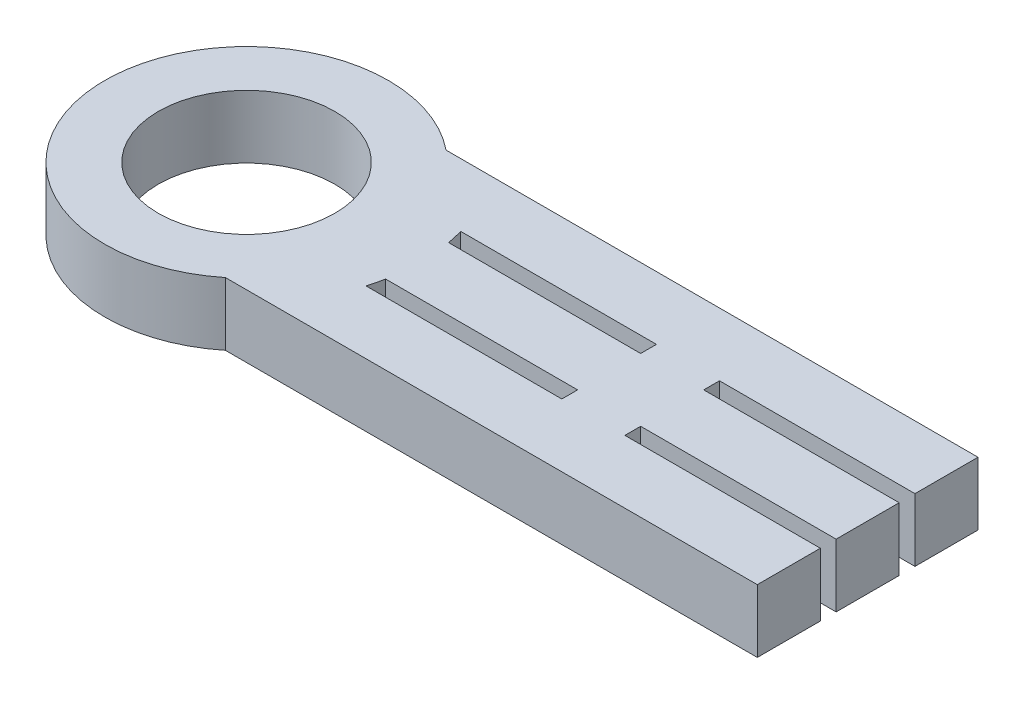
ISO-10303-21;
HEADER;
FILE_DESCRIPTION(('STEP AP214'),'2;1');
FILE_NAME('part.step','',(''),(''),'','','');
FILE_SCHEMA(('AUTOMOTIVE_DESIGN { 1 0 10303 214 1 1 1 1 }'));
ENDSEC;
DATA;
#1=APPLICATION_CONTEXT('core data for automotive mechanical design processes');
#2=APPLICATION_PROTOCOL_DEFINITION('international standard','automotive_design',2000,#1);
#3=PRODUCT_CONTEXT('',#1,'mechanical');
#4=PRODUCT('Part','Part','',(#3));
#5=PRODUCT_RELATED_PRODUCT_CATEGORY('part','',(#4));
#6=PRODUCT_DEFINITION_FORMATION('','',#4);
#7=PRODUCT_DEFINITION_CONTEXT('part definition',#1,'design');
#8=PRODUCT_DEFINITION('design','',#6,#7);
#9=PRODUCT_DEFINITION_SHAPE('','',#8);
#10=(LENGTH_UNIT() NAMED_UNIT(*) SI_UNIT(.MILLI.,.METRE.));
#11=(NAMED_UNIT(*) PLANE_ANGLE_UNIT() SI_UNIT($,.RADIAN.));
#12=(NAMED_UNIT(*) SI_UNIT($,.STERADIAN.) SOLID_ANGLE_UNIT());
#13=UNCERTAINTY_MEASURE_WITH_UNIT(LENGTH_MEASURE(1.E-05),#10,'distance_accuracy_value','');
#14=(GEOMETRIC_REPRESENTATION_CONTEXT(3) GLOBAL_UNCERTAINTY_ASSIGNED_CONTEXT((#13)) GLOBAL_UNIT_ASSIGNED_CONTEXT((#10,
#11,#12)) REPRESENTATION_CONTEXT('',''));
#15=CARTESIAN_POINT('',(0.,0.,0.));
#16=DIRECTION('',(0.,0.,1.));
#17=DIRECTION('',(1.,0.,0.));
#18=AXIS2_PLACEMENT_3D('',#15,#16,#17);
#19=CARTESIAN_POINT('',(0.,20.,0.));
#20=DIRECTION('',(0.,1.,0.));
#21=DIRECTION('',(0.,0.,1.));
#22=AXIS2_PLACEMENT_3D('',#19,#20,#21);
#23=PLANE('',#22);
#24=DIRECTION('',(0.,0.,-1.));
#25=VECTOR('',#24,1.);
#26=CARTESIAN_POINT('',(115.,20.,15.));
#27=LINE('',#26,#25);
#28=CARTESIAN_POINT('',(115.,20.,15.));
#29=VERTEX_POINT('',#28);
#30=CARTESIAN_POINT('',(115.,20.,10.));
#31=VERTEX_POINT('',#30);
#32=EDGE_CURVE('E289',#29,#31,#27,.T.);
#33=ORIENTED_EDGE('',*,*,#32,.F.);
#34=DIRECTION('',(-1.,0.,0.));
#35=VECTOR('',#34,1.);
#36=CARTESIAN_POINT('',(52.9150262212918,20.,15.));
#37=LINE('',#36,#35);
#38=CARTESIAN_POINT('',(52.9150262212918,20.,15.));
#39=VERTEX_POINT('',#38);
#40=EDGE_CURVE('E362',#29,#39,#37,.T.);
#41=ORIENTED_EDGE('',*,*,#40,.T.);
#42=CARTESIAN_POINT('',(0.,20.,0.));
#43=DIRECTION('',(0.,1.,0.));
#44=DIRECTION('',(0.,0.,1.));
#45=AXIS2_PLACEMENT_3D('',#42,#43,#44);
#46=CIRCLE('',#45,55.);
#47=CARTESIAN_POINT('',(54.0832691319598,20.,10.));
#48=VERTEX_POINT('',#47);
#49=EDGE_CURVE('E358',#39,#48,#46,.T.);
#50=ORIENTED_EDGE('',*,*,#49,.T.);
#51=DIRECTION('',(1.,0.,0.));
#52=VECTOR('',#51,1.);
#53=CARTESIAN_POINT('',(54.0832691319598,20.,10.));
#54=LINE('',#53,#52);
#55=EDGE_CURVE('E368',#48,#31,#54,.T.);
#56=ORIENTED_EDGE('',*,*,#55,.T.);
#57=EDGE_LOOP('',(#33,#41,#50,#56));
#58=FACE_BOUND('',#57,.T.);
#59=CARTESIAN_POINT('',(0.,20.,0.));
#60=DIRECTION('',(0.,1.,0.));
#61=DIRECTION('',(0.,0.,1.));
#62=AXIS2_PLACEMENT_3D('',#59,#60,#61);
#63=CIRCLE('',#62,28.);
#64=CARTESIAN_POINT('',(0.,20.,28.));
#65=VERTEX_POINT('',#64);
#66=EDGE_CURVE('E338',#65,#65,#63,.T.);
#67=ORIENTED_EDGE('',*,*,#66,.F.);
#68=EDGE_LOOP('',(#67));
#69=FACE_BOUND('',#68,.T.);
#70=DIRECTION('',(0.,0.,1.));
#71=VECTOR('',#70,1.);
#72=CARTESIAN_POINT('',(115.,20.,-15.));
#73=LINE('',#72,#71);
#74=CARTESIAN_POINT('',(115.,20.,-15.));
#75=VERTEX_POINT('',#74);
#76=CARTESIAN_POINT('',(115.,20.,-10.));
#77=VERTEX_POINT('',#76);
#78=EDGE_CURVE('E307',#75,#77,#73,.T.);
#79=ORIENTED_EDGE('',*,*,#78,.T.);
#80=DIRECTION('',(1.,0.,0.));
#81=VECTOR('',#80,1.);
#82=CARTESIAN_POINT('',(54.0832691319598,20.,-10.));
#83=LINE('',#82,#81);
#84=CARTESIAN_POINT('',(54.0832691319598,20.,-10.));
#85=VERTEX_POINT('',#84);
#86=EDGE_CURVE('E222',#85,#77,#83,.T.);
#87=ORIENTED_EDGE('',*,*,#86,.F.);
#88=CARTESIAN_POINT('',(0.,20.,0.));
#89=DIRECTION('',(0.,-1.,0.));
#90=DIRECTION('',(0.,0.,-1.));
#91=AXIS2_PLACEMENT_3D('',#88,#89,#90);
#92=CIRCLE('',#91,55.);
#93=CARTESIAN_POINT('',(52.9150262212918,20.,-15.));
#94=VERTEX_POINT('',#93);
#95=EDGE_CURVE('E217',#94,#85,#92,.T.);
#96=ORIENTED_EDGE('',*,*,#95,.F.);
#97=DIRECTION('',(-1.,0.,0.));
#98=VECTOR('',#97,1.);
#99=CARTESIAN_POINT('',(52.9150262212918,20.,-15.));
#100=LINE('',#99,#98);
#101=EDGE_CURVE('E225',#75,#94,#100,.T.);
#102=ORIENTED_EDGE('',*,*,#101,.F.);
#103=EDGE_LOOP('',(#79,#87,#96,#102));
#104=FACE_BOUND('',#103,.T.);
#105=DIRECTION('',(-1.,0.,0.));
#106=VECTOR('',#105,1.);
#107=CARTESIAN_POINT('',(28.2842712474619,20.,35.));
#108=LINE('',#107,#106);
#109=CARTESIAN_POINT('',(197.,20.,35.));
#110=VERTEX_POINT('',#109);
#111=CARTESIAN_POINT('',(28.2842712474619,20.,35.));
#112=VERTEX_POINT('',#111);
#113=EDGE_CURVE('E204',#110,#112,#108,.T.);
#114=ORIENTED_EDGE('',*,*,#113,.F.);
#115=DIRECTION('',(0.,0.,1.));
#116=VECTOR('',#115,1.);
#117=CARTESIAN_POINT('',(197.,20.,35.));
#118=LINE('',#117,#116);
#119=CARTESIAN_POINT('',(197.,20.,15.));
#120=VERTEX_POINT('',#119);
#121=EDGE_CURVE('E58',#120,#110,#118,.T.);
#122=ORIENTED_EDGE('',*,*,#121,.F.);
#123=CARTESIAN_POINT('',(135.,20.,15.));
#124=VERTEX_POINT('',#123);
#125=EDGE_CURVE('E364',#120,#124,#37,.T.);
#126=ORIENTED_EDGE('',*,*,#125,.T.);
#127=DIRECTION('',(0.,0.,1.));
#128=VECTOR('',#127,1.);
#129=CARTESIAN_POINT('',(135.,20.,15.));
#130=LINE('',#129,#128);
#131=CARTESIAN_POINT('',(135.,20.,10.));
#132=VERTEX_POINT('',#131);
#133=EDGE_CURVE('E294',#132,#124,#130,.T.);
#134=ORIENTED_EDGE('',*,*,#133,.F.);
#135=CARTESIAN_POINT('',(197.,20.,10.));
#136=VERTEX_POINT('',#135);
#137=EDGE_CURVE('E367',#132,#136,#54,.T.);
#138=ORIENTED_EDGE('',*,*,#137,.T.);
#139=DIRECTION('',(0.,0.,1.));
#140=VECTOR('',#139,1.);
#141=CARTESIAN_POINT('',(197.,20.,10.));
#142=LINE('',#141,#140);
#143=CARTESIAN_POINT('',(197.,20.,-9.99999999999999));
#144=VERTEX_POINT('',#143);
#145=EDGE_CURVE('E286',#144,#136,#142,.T.);
#146=ORIENTED_EDGE('',*,*,#145,.F.);
#147=CARTESIAN_POINT('',(135.,20.,-10.));
#148=VERTEX_POINT('',#147);
#149=EDGE_CURVE('E220',#148,#144,#83,.T.);
#150=ORIENTED_EDGE('',*,*,#149,.F.);
#151=DIRECTION('',(0.,0.,-1.));
#152=VECTOR('',#151,1.);
#153=CARTESIAN_POINT('',(135.,20.,-15.));
#154=LINE('',#153,#152);
#155=CARTESIAN_POINT('',(135.,20.,-15.));
#156=VERTEX_POINT('',#155);
#157=EDGE_CURVE('E324',#148,#156,#154,.T.);
#158=ORIENTED_EDGE('',*,*,#157,.T.);
#159=CARTESIAN_POINT('',(197.,20.,-15.));
#160=VERTEX_POINT('',#159);
#161=EDGE_CURVE('E226',#160,#156,#100,.T.);
#162=ORIENTED_EDGE('',*,*,#161,.F.);
#163=DIRECTION('',(0.,0.,1.));
#164=VECTOR('',#163,1.);
#165=CARTESIAN_POINT('',(197.,20.,-15.));
#166=LINE('',#165,#164);
#167=CARTESIAN_POINT('',(197.,20.,-35.));
#168=VERTEX_POINT('',#167);
#169=EDGE_CURVE('E186',#168,#160,#166,.T.);
#170=ORIENTED_EDGE('',*,*,#169,.F.);
#171=DIRECTION('',(-1.,0.,0.));
#172=VECTOR('',#171,1.);
#173=CARTESIAN_POINT('',(28.2842712474619,20.,-35.));
#174=LINE('',#173,#172);
#175=CARTESIAN_POINT('',(28.2842712474619,20.,-35.));
#176=VERTEX_POINT('',#175);
#177=EDGE_CURVE('E51',#168,#176,#174,.T.);
#178=ORIENTED_EDGE('',*,*,#177,.T.);
#179=CARTESIAN_POINT('',(0.,20.,0.));
#180=DIRECTION('',(0.,1.,0.));
#181=DIRECTION('',(0.,0.,1.));
#182=AXIS2_PLACEMENT_3D('',#179,#180,#181);
#183=CIRCLE('',#182,45.);
#184=EDGE_CURVE('E249',#176,#112,#183,.T.);
#185=ORIENTED_EDGE('',*,*,#184,.T.);
#186=EDGE_LOOP('',(#114,#122,#126,#134,#138,#146,#150,#158,#162,#170,#178,#185));
#187=FACE_BOUND('',#186,.T.);
#188=ADVANCED_FACE('F42',(#58,#69,#104,#187),#23,.T.);
#189=CARTESIAN_POINT('',(0.,0.,0.));
#190=DIRECTION('',(0.,1.,0.));
#191=DIRECTION('',(0.,0.,1.));
#192=AXIS2_PLACEMENT_3D('',#189,#190,#191);
#193=PLANE('',#192);
#194=DIRECTION('',(1.,0.,0.));
#195=VECTOR('',#194,1.);
#196=CARTESIAN_POINT('',(54.0832691319598,0.,-10.));
#197=LINE('',#196,#195);
#198=CARTESIAN_POINT('',(54.0832691319598,0.,-10.));
#199=VERTEX_POINT('',#198);
#200=CARTESIAN_POINT('',(115.,0.,-10.));
#201=VERTEX_POINT('',#200);
#202=EDGE_CURVE('E234',#199,#201,#197,.T.);
#203=ORIENTED_EDGE('',*,*,#202,.T.);
#204=DIRECTION('',(0.,0.,1.));
#205=VECTOR('',#204,1.);
#206=CARTESIAN_POINT('',(115.,0.,-15.));
#207=LINE('',#206,#205);
#208=CARTESIAN_POINT('',(115.,0.,-15.));
#209=VERTEX_POINT('',#208);
#210=EDGE_CURVE('E319',#209,#201,#207,.T.);
#211=ORIENTED_EDGE('',*,*,#210,.F.);
#212=DIRECTION('',(-1.,0.,0.));
#213=VECTOR('',#212,1.);
#214=CARTESIAN_POINT('',(52.9150262212918,0.,-15.));
#215=LINE('',#214,#213);
#216=CARTESIAN_POINT('',(52.9150262212918,0.,-15.));
#217=VERTEX_POINT('',#216);
#218=EDGE_CURVE('E238',#209,#217,#215,.T.);
#219=ORIENTED_EDGE('',*,*,#218,.T.);
#220=CARTESIAN_POINT('',(0.,0.,0.));
#221=DIRECTION('',(0.,-1.,0.));
#222=DIRECTION('',(0.,0.,-1.));
#223=AXIS2_PLACEMENT_3D('',#220,#221,#222);
#224=CIRCLE('',#223,55.);
#225=EDGE_CURVE('E216',#217,#199,#224,.T.);
#226=ORIENTED_EDGE('',*,*,#225,.T.);
#227=EDGE_LOOP('',(#203,#211,#219,#226));
#228=FACE_BOUND('',#227,.T.);
#229=CARTESIAN_POINT('',(0.,0.,0.));
#230=DIRECTION('',(0.,1.,0.));
#231=DIRECTION('',(0.,0.,1.));
#232=AXIS2_PLACEMENT_3D('',#229,#230,#231);
#233=CIRCLE('',#232,28.);
#234=CARTESIAN_POINT('',(0.,0.,28.));
#235=VERTEX_POINT('',#234);
#236=EDGE_CURVE('E350',#235,#235,#233,.T.);
#237=ORIENTED_EDGE('',*,*,#236,.T.);
#238=EDGE_LOOP('',(#237));
#239=FACE_BOUND('',#238,.T.);
#240=DIRECTION('',(-1.,0.,0.));
#241=VECTOR('',#240,1.);
#242=CARTESIAN_POINT('',(52.9150262212918,0.,15.));
#243=LINE('',#242,#241);
#244=CARTESIAN_POINT('',(115.,0.,15.));
#245=VERTEX_POINT('',#244);
#246=CARTESIAN_POINT('',(52.9150262212918,0.,15.));
#247=VERTEX_POINT('',#246);
#248=EDGE_CURVE('E374',#245,#247,#243,.T.);
#249=ORIENTED_EDGE('',*,*,#248,.F.);
#250=DIRECTION('',(0.,0.,-1.));
#251=VECTOR('',#250,1.);
#252=CARTESIAN_POINT('',(115.,0.,15.));
#253=LINE('',#252,#251);
#254=CARTESIAN_POINT('',(115.,0.,10.));
#255=VERTEX_POINT('',#254);
#256=EDGE_CURVE('E290',#245,#255,#253,.T.);
#257=ORIENTED_EDGE('',*,*,#256,.T.);
#258=DIRECTION('',(1.,0.,0.));
#259=VECTOR('',#258,1.);
#260=CARTESIAN_POINT('',(54.0832691319598,0.,10.));
#261=LINE('',#260,#259);
#262=CARTESIAN_POINT('',(54.0832691319598,0.,10.));
#263=VERTEX_POINT('',#262);
#264=EDGE_CURVE('E363',#263,#255,#261,.T.);
#265=ORIENTED_EDGE('',*,*,#264,.F.);
#266=CARTESIAN_POINT('',(0.,0.,0.));
#267=DIRECTION('',(0.,1.,0.));
#268=DIRECTION('',(0.,0.,1.));
#269=AXIS2_PLACEMENT_3D('',#266,#267,#268);
#270=CIRCLE('',#269,55.);
#271=EDGE_CURVE('E354',#247,#263,#270,.T.);
#272=ORIENTED_EDGE('',*,*,#271,.F.);
#273=EDGE_LOOP('',(#249,#257,#265,#272));
#274=FACE_BOUND('',#273,.T.);
#275=DIRECTION('',(0.,0.,-1.));
#276=VECTOR('',#275,1.);
#277=CARTESIAN_POINT('',(197.,0.,35.));
#278=LINE('',#277,#276);
#279=CARTESIAN_POINT('',(197.,0.,35.));
#280=VERTEX_POINT('',#279);
#281=CARTESIAN_POINT('',(197.,0.,15.));
#282=VERTEX_POINT('',#281);
#283=EDGE_CURVE('E180',#280,#282,#278,.T.);
#284=ORIENTED_EDGE('',*,*,#283,.F.);
#285=DIRECTION('',(-1.,0.,0.));
#286=VECTOR('',#285,1.);
#287=CARTESIAN_POINT('',(28.2842712474619,0.,35.));
#288=LINE('',#287,#286);
#289=CARTESIAN_POINT('',(28.2842712474619,0.,35.));
#290=VERTEX_POINT('',#289);
#291=EDGE_CURVE('E192',#280,#290,#288,.T.);
#292=ORIENTED_EDGE('',*,*,#291,.T.);
#293=CARTESIAN_POINT('',(0.,0.,0.));
#294=DIRECTION('',(0.,1.,0.));
#295=DIRECTION('',(0.,0.,1.));
#296=AXIS2_PLACEMENT_3D('',#293,#294,#295);
#297=CIRCLE('',#296,45.);
#298=CARTESIAN_POINT('',(28.2842712474619,0.,-35.));
#299=VERTEX_POINT('',#298);
#300=EDGE_CURVE('E248',#299,#290,#297,.T.);
#301=ORIENTED_EDGE('',*,*,#300,.F.);
#302=DIRECTION('',(-1.,0.,0.));
#303=VECTOR('',#302,1.);
#304=CARTESIAN_POINT('',(28.2842712474619,0.,-35.));
#305=LINE('',#304,#303);
#306=CARTESIAN_POINT('',(197.,0.,-35.));
#307=VERTEX_POINT('',#306);
#308=EDGE_CURVE('E253',#307,#299,#305,.T.);
#309=ORIENTED_EDGE('',*,*,#308,.F.);
#310=DIRECTION('',(0.,0.,-1.));
#311=VECTOR('',#310,1.);
#312=CARTESIAN_POINT('',(197.,0.,-15.));
#313=LINE('',#312,#311);
#314=CARTESIAN_POINT('',(197.,0.,-15.));
#315=VERTEX_POINT('',#314);
#316=EDGE_CURVE('E66',#315,#307,#313,.T.);
#317=ORIENTED_EDGE('',*,*,#316,.F.);
#318=CARTESIAN_POINT('',(135.,0.,-15.));
#319=VERTEX_POINT('',#318);
#320=EDGE_CURVE('E221',#315,#319,#215,.T.);
#321=ORIENTED_EDGE('',*,*,#320,.T.);
#322=DIRECTION('',(0.,0.,-1.));
#323=VECTOR('',#322,1.);
#324=CARTESIAN_POINT('',(135.,0.,-15.));
#325=LINE('',#324,#323);
#326=CARTESIAN_POINT('',(135.,0.,-10.));
#327=VERTEX_POINT('',#326);
#328=EDGE_CURVE('E323',#327,#319,#325,.T.);
#329=ORIENTED_EDGE('',*,*,#328,.F.);
#330=CARTESIAN_POINT('',(197.,0.,-10.));
#331=VERTEX_POINT('',#330);
#332=EDGE_CURVE('E233',#327,#331,#197,.T.);
#333=ORIENTED_EDGE('',*,*,#332,.T.);
#334=DIRECTION('',(0.,0.,-1.));
#335=VECTOR('',#334,1.);
#336=CARTESIAN_POINT('',(197.,0.,10.));
#337=LINE('',#336,#335);
#338=CARTESIAN_POINT('',(197.,0.,10.));
#339=VERTEX_POINT('',#338);
#340=EDGE_CURVE('E280',#339,#331,#337,.T.);
#341=ORIENTED_EDGE('',*,*,#340,.F.);
#342=CARTESIAN_POINT('',(135.,0.,10.));
#343=VERTEX_POINT('',#342);
#344=EDGE_CURVE('E377',#343,#339,#261,.T.);
#345=ORIENTED_EDGE('',*,*,#344,.F.);
#346=DIRECTION('',(0.,0.,1.));
#347=VECTOR('',#346,1.);
#348=CARTESIAN_POINT('',(135.,0.,15.));
#349=LINE('',#348,#347);
#350=CARTESIAN_POINT('',(135.,0.,15.));
#351=VERTEX_POINT('',#350);
#352=EDGE_CURVE('E293',#343,#351,#349,.T.);
#353=ORIENTED_EDGE('',*,*,#352,.T.);
#354=EDGE_CURVE('E195',#282,#351,#243,.T.);
#355=ORIENTED_EDGE('',*,*,#354,.F.);
#356=EDGE_LOOP('',(#284,#292,#301,#309,#317,#321,#329,#333,#341,#345,#353,#355));
#357=FACE_BOUND('',#356,.T.);
#358=ADVANCED_FACE('F190',(#228,#239,#274,#357),#193,.F.);
#359=CARTESIAN_POINT('',(52.9150262212918,20.,15.));
#360=DIRECTION('',(0.,0.,1.));
#361=DIRECTION('',(1.,0.,0.));
#362=AXIS2_PLACEMENT_3D('',#359,#360,#361);
#363=PLANE('',#362);
#364=DIRECTION('',(0.,1.,0.));
#365=VECTOR('',#364,1.);
#366=CARTESIAN_POINT('',(197.,20.,15.));
#367=LINE('',#366,#365);
#368=EDGE_CURVE('E197',#282,#120,#367,.T.);
#369=ORIENTED_EDGE('',*,*,#368,.F.);
#370=ORIENTED_EDGE('',*,*,#354,.T.);
#371=DIRECTION('',(0.,1.,0.));
#372=VECTOR('',#371,1.);
#373=CARTESIAN_POINT('',(135.,0.,15.));
#374=LINE('',#373,#372);
#375=EDGE_CURVE('E312',#351,#124,#374,.T.);
#376=ORIENTED_EDGE('',*,*,#375,.T.);
#377=ORIENTED_EDGE('',*,*,#125,.F.);
#378=EDGE_LOOP('',(#369,#370,#376,#377));
#379=FACE_BOUND('',#378,.T.);
#380=ADVANCED_FACE('F454',(#379),#363,.F.);
#381=CARTESIAN_POINT('',(28.2842712474619,20.,35.));
#382=DIRECTION('',(0.,0.,1.));
#383=DIRECTION('',(1.,0.,0.));
#384=AXIS2_PLACEMENT_3D('',#381,#382,#383);
#385=PLANE('',#384);
#386=ORIENTED_EDGE('',*,*,#291,.F.);
#387=DIRECTION('',(0.,-1.,0.));
#388=VECTOR('',#387,1.);
#389=CARTESIAN_POINT('',(197.,20.,35.));
#390=LINE('',#389,#388);
#391=EDGE_CURVE('E177',#110,#280,#390,.T.);
#392=ORIENTED_EDGE('',*,*,#391,.F.);
#393=ORIENTED_EDGE('',*,*,#113,.T.);
#394=DIRECTION('',(0.,-1.,0.));
#395=VECTOR('',#394,1.);
#396=CARTESIAN_POINT('',(28.2842712474619,20.,35.));
#397=LINE('',#396,#395);
#398=EDGE_CURVE('E202',#112,#290,#397,.T.);
#399=ORIENTED_EDGE('',*,*,#398,.T.);
#400=EDGE_LOOP('',(#386,#392,#393,#399));
#401=FACE_BOUND('',#400,.T.);
#402=ADVANCED_FACE('F200',(#401),#385,.T.);
#403=CARTESIAN_POINT('',(52.9150262212918,20.,-15.));
#404=DIRECTION('',(0.,0.,1.));
#405=DIRECTION('',(1.,0.,0.));
#406=AXIS2_PLACEMENT_3D('',#403,#404,#405);
#407=PLANE('',#406);
#408=ORIENTED_EDGE('',*,*,#320,.F.);
#409=DIRECTION('',(0.,-1.,0.));
#410=VECTOR('',#409,1.);
#411=CARTESIAN_POINT('',(197.,20.,-15.));
#412=LINE('',#411,#410);
#413=EDGE_CURVE('E410',#160,#315,#412,.T.);
#414=ORIENTED_EDGE('',*,*,#413,.F.);
#415=ORIENTED_EDGE('',*,*,#161,.T.);
#416=DIRECTION('',(0.,1.,0.));
#417=VECTOR('',#416,1.);
#418=CARTESIAN_POINT('',(135.,0.,-15.));
#419=LINE('',#418,#417);
#420=EDGE_CURVE('E339',#319,#156,#419,.T.);
#421=ORIENTED_EDGE('',*,*,#420,.F.);
#422=EDGE_LOOP('',(#408,#414,#415,#421));
#423=FACE_BOUND('',#422,.T.);
#424=ADVANCED_FACE('F418',(#423),#407,.T.);
#425=CARTESIAN_POINT('',(28.2842712474619,20.,-35.));
#426=DIRECTION('',(0.,0.,1.));
#427=DIRECTION('',(1.,0.,0.));
#428=AXIS2_PLACEMENT_3D('',#425,#426,#427);
#429=PLANE('',#428);
#430=DIRECTION('',(0.,1.,0.));
#431=VECTOR('',#430,1.);
#432=CARTESIAN_POINT('',(197.,20.,-35.));
#433=LINE('',#432,#431);
#434=EDGE_CURVE('E264',#307,#168,#433,.T.);
#435=ORIENTED_EDGE('',*,*,#434,.F.);
#436=ORIENTED_EDGE('',*,*,#308,.T.);
#437=DIRECTION('',(0.,-1.,0.));
#438=VECTOR('',#437,1.);
#439=CARTESIAN_POINT('',(28.2842712474619,20.,-35.));
#440=LINE('',#439,#438);
#441=EDGE_CURVE('E11',#176,#299,#440,.T.);
#442=ORIENTED_EDGE('',*,*,#441,.F.);
#443=ORIENTED_EDGE('',*,*,#177,.F.);
#444=EDGE_LOOP('',(#435,#436,#442,#443));
#445=FACE_BOUND('',#444,.T.);
#446=ADVANCED_FACE('F261',(#445),#429,.F.);
#447=CARTESIAN_POINT('',(54.0832691319598,20.,10.));
#448=DIRECTION('',(0.,0.,-1.));
#449=DIRECTION('',(-1.,0.,0.));
#450=AXIS2_PLACEMENT_3D('',#447,#448,#449);
#451=PLANE('',#450);
#452=DIRECTION('',(0.,-1.,0.));
#453=VECTOR('',#452,1.);
#454=CARTESIAN_POINT('',(197.,20.,10.));
#455=LINE('',#454,#453);
#456=EDGE_CURVE('E277',#136,#339,#455,.T.);
#457=ORIENTED_EDGE('',*,*,#456,.F.);
#458=ORIENTED_EDGE('',*,*,#137,.F.);
#459=DIRECTION('',(0.,1.,0.));
#460=VECTOR('',#459,1.);
#461=CARTESIAN_POINT('',(135.,0.,10.));
#462=LINE('',#461,#460);
#463=EDGE_CURVE('E308',#343,#132,#462,.T.);
#464=ORIENTED_EDGE('',*,*,#463,.F.);
#465=ORIENTED_EDGE('',*,*,#344,.T.);
#466=EDGE_LOOP('',(#457,#458,#464,#465));
#467=FACE_BOUND('',#466,.T.);
#468=ADVANCED_FACE('F472',(#467),#451,.F.);
#469=CARTESIAN_POINT('',(54.0832691319598,20.,-10.));
#470=DIRECTION('',(0.,0.,-1.));
#471=DIRECTION('',(-1.,0.,0.));
#472=AXIS2_PLACEMENT_3D('',#469,#470,#471);
#473=PLANE('',#472);
#474=ORIENTED_EDGE('',*,*,#149,.T.);
#475=DIRECTION('',(0.,1.,0.));
#476=VECTOR('',#475,1.);
#477=CARTESIAN_POINT('',(197.,20.,-9.99999999999999));
#478=LINE('',#477,#476);
#479=EDGE_CURVE('E283',#331,#144,#478,.T.);
#480=ORIENTED_EDGE('',*,*,#479,.F.);
#481=ORIENTED_EDGE('',*,*,#332,.F.);
#482=DIRECTION('',(0.,1.,0.));
#483=VECTOR('',#482,1.);
#484=CARTESIAN_POINT('',(135.,0.,-10.));
#485=LINE('',#484,#483);
#486=EDGE_CURVE('E343',#327,#148,#485,.T.);
#487=ORIENTED_EDGE('',*,*,#486,.T.);
#488=EDGE_LOOP('',(#474,#480,#481,#487));
#489=FACE_BOUND('',#488,.T.);
#490=ADVANCED_FACE('F478',(#489),#473,.T.);
#491=CARTESIAN_POINT('',(0.,20.,0.));
#492=DIRECTION('',(0.,-1.,0.));
#493=DIRECTION('',(0.,0.,-1.));
#494=AXIS2_PLACEMENT_3D('',#491,#492,#493);
#495=CYLINDRICAL_SURFACE('',#494,55.);
#496=ORIENTED_EDGE('',*,*,#225,.F.);
#497=DIRECTION('',(0.,-1.,0.));
#498=VECTOR('',#497,1.);
#499=CARTESIAN_POINT('',(52.9150262212918,20.,-15.));
#500=LINE('',#499,#498);
#501=EDGE_CURVE('E229',#94,#217,#500,.T.);
#502=ORIENTED_EDGE('',*,*,#501,.F.);
#503=ORIENTED_EDGE('',*,*,#95,.T.);
#504=DIRECTION('',(0.,-1.,0.));
#505=VECTOR('',#504,1.);
#506=CARTESIAN_POINT('',(54.0832691319598,20.,-10.));
#507=LINE('',#506,#505);
#508=EDGE_CURVE('E244',#85,#199,#507,.T.);
#509=ORIENTED_EDGE('',*,*,#508,.T.);
#510=EDGE_LOOP('',(#496,#502,#503,#509));
#511=FACE_BOUND('',#510,.T.);
#512=ADVANCED_FACE('F443',(#511),#495,.T.);
#513=DIRECTION('',(0.,1.,0.));
#514=VECTOR('',#513,1.);
#515=CARTESIAN_POINT('',(115.,0.,-15.));
#516=LINE('',#515,#514);
#517=EDGE_CURVE('E334',#209,#75,#516,.T.);
#518=ORIENTED_EDGE('',*,*,#517,.T.);
#519=ORIENTED_EDGE('',*,*,#101,.T.);
#520=ORIENTED_EDGE('',*,*,#501,.T.);
#521=ORIENTED_EDGE('',*,*,#218,.F.);
#522=EDGE_LOOP('',(#518,#519,#520,#521));
#523=FACE_BOUND('',#522,.T.);
#524=ADVANCED_FACE('F436',(#523),#407,.T.);
#525=CARTESIAN_POINT('',(115.,0.,-15.));
#526=DIRECTION('',(-1.,0.,0.));
#527=DIRECTION('',(0.,0.,1.));
#528=AXIS2_PLACEMENT_3D('',#525,#526,#527);
#529=PLANE('',#528);
#530=ORIENTED_EDGE('',*,*,#78,.F.);
#531=ORIENTED_EDGE('',*,*,#517,.F.);
#532=ORIENTED_EDGE('',*,*,#210,.T.);
#533=DIRECTION('',(0.,1.,0.));
#534=VECTOR('',#533,1.);
#535=CARTESIAN_POINT('',(115.,0.,-10.));
#536=LINE('',#535,#534);
#537=EDGE_CURVE('E328',#201,#77,#536,.T.);
#538=ORIENTED_EDGE('',*,*,#537,.T.);
#539=EDGE_LOOP('',(#530,#531,#532,#538));
#540=FACE_BOUND('',#539,.T.);
#541=ADVANCED_FACE('F449',(#540),#529,.T.);
#542=ORIENTED_EDGE('',*,*,#537,.F.);
#543=ORIENTED_EDGE('',*,*,#202,.F.);
#544=ORIENTED_EDGE('',*,*,#508,.F.);
#545=ORIENTED_EDGE('',*,*,#86,.T.);
#546=EDGE_LOOP('',(#542,#543,#544,#545));
#547=FACE_BOUND('',#546,.T.);
#548=ADVANCED_FACE('F447',(#547),#473,.T.);
#549=CARTESIAN_POINT('',(0.,0.,0.));
#550=DIRECTION('',(0.,1.,0.));
#551=DIRECTION('',(0.,0.,1.));
#552=AXIS2_PLACEMENT_3D('',#549,#550,#551);
#553=CYLINDRICAL_SURFACE('',#552,28.);
#554=ORIENTED_EDGE('',*,*,#236,.F.);
#555=EDGE_LOOP('',(#554));
#556=FACE_BOUND('',#555,.T.);
#557=ORIENTED_EDGE('',*,*,#66,.T.);
#558=EDGE_LOOP('',(#557));
#559=FACE_BOUND('',#558,.T.);
#560=ADVANCED_FACE('F458',(#556,#559),#553,.F.);
#561=CARTESIAN_POINT('',(135.,0.,15.));
#562=DIRECTION('',(-1.,0.,0.));
#563=DIRECTION('',(0.,0.,1.));
#564=AXIS2_PLACEMENT_3D('',#561,#562,#563);
#565=PLANE('',#564);
#566=ORIENTED_EDGE('',*,*,#133,.T.);
#567=ORIENTED_EDGE('',*,*,#375,.F.);
#568=ORIENTED_EDGE('',*,*,#352,.F.);
#569=ORIENTED_EDGE('',*,*,#463,.T.);
#570=EDGE_LOOP('',(#566,#567,#568,#569));
#571=FACE_BOUND('',#570,.T.);
#572=ADVANCED_FACE('F461',(#571),#565,.F.);
#573=CARTESIAN_POINT('',(0.,20.,0.));
#574=DIRECTION('',(0.,-1.,0.));
#575=DIRECTION('',(0.,0.,-1.));
#576=AXIS2_PLACEMENT_3D('',#573,#574,#575);
#577=CYLINDRICAL_SURFACE('',#576,55.);
#578=ORIENTED_EDGE('',*,*,#271,.T.);
#579=DIRECTION('',(0.,-1.,0.));
#580=VECTOR('',#579,1.);
#581=CARTESIAN_POINT('',(54.0832691319598,20.,10.));
#582=LINE('',#581,#580);
#583=EDGE_CURVE('E211',#48,#263,#582,.T.);
#584=ORIENTED_EDGE('',*,*,#583,.F.);
#585=ORIENTED_EDGE('',*,*,#49,.F.);
#586=DIRECTION('',(0.,-1.,0.));
#587=VECTOR('',#586,1.);
#588=CARTESIAN_POINT('',(52.9150262212918,20.,15.));
#589=LINE('',#588,#587);
#590=EDGE_CURVE('E205',#39,#247,#589,.T.);
#591=ORIENTED_EDGE('',*,*,#590,.T.);
#592=EDGE_LOOP('',(#578,#584,#585,#591));
#593=FACE_BOUND('',#592,.T.);
#594=ADVANCED_FACE('F400',(#593),#577,.T.);
#595=DIRECTION('',(0.,1.,0.));
#596=VECTOR('',#595,1.);
#597=CARTESIAN_POINT('',(115.,0.,10.));
#598=LINE('',#597,#596);
#599=EDGE_CURVE('E303',#255,#31,#598,.T.);
#600=ORIENTED_EDGE('',*,*,#599,.T.);
#601=ORIENTED_EDGE('',*,*,#55,.F.);
#602=ORIENTED_EDGE('',*,*,#583,.T.);
#603=ORIENTED_EDGE('',*,*,#264,.T.);
#604=EDGE_LOOP('',(#600,#601,#602,#603));
#605=FACE_BOUND('',#604,.T.);
#606=ADVANCED_FACE('F386',(#605),#451,.F.);
#607=CARTESIAN_POINT('',(115.,0.,15.));
#608=DIRECTION('',(1.,0.,0.));
#609=DIRECTION('',(0.,0.,-1.));
#610=AXIS2_PLACEMENT_3D('',#607,#608,#609);
#611=PLANE('',#610);
#612=ORIENTED_EDGE('',*,*,#32,.T.);
#613=ORIENTED_EDGE('',*,*,#599,.F.);
#614=ORIENTED_EDGE('',*,*,#256,.F.);
#615=DIRECTION('',(0.,1.,0.));
#616=VECTOR('',#615,1.);
#617=CARTESIAN_POINT('',(115.,0.,15.));
#618=LINE('',#617,#616);
#619=EDGE_CURVE('E297',#245,#29,#618,.T.);
#620=ORIENTED_EDGE('',*,*,#619,.T.);
#621=EDGE_LOOP('',(#612,#613,#614,#620));
#622=FACE_BOUND('',#621,.T.);
#623=ADVANCED_FACE('F395',(#622),#611,.F.);
#624=ORIENTED_EDGE('',*,*,#619,.F.);
#625=ORIENTED_EDGE('',*,*,#248,.T.);
#626=ORIENTED_EDGE('',*,*,#590,.F.);
#627=ORIENTED_EDGE('',*,*,#40,.F.);
#628=EDGE_LOOP('',(#624,#625,#626,#627));
#629=FACE_BOUND('',#628,.T.);
#630=ADVANCED_FACE('F402',(#629),#363,.F.);
#631=CARTESIAN_POINT('',(0.,20.,0.));
#632=DIRECTION('',(0.,-1.,0.));
#633=DIRECTION('',(0.,0.,-1.));
#634=AXIS2_PLACEMENT_3D('',#631,#632,#633);
#635=CYLINDRICAL_SURFACE('',#634,45.);
#636=ORIENTED_EDGE('',*,*,#300,.T.);
#637=ORIENTED_EDGE('',*,*,#398,.F.);
#638=ORIENTED_EDGE('',*,*,#184,.F.);
#639=ORIENTED_EDGE('',*,*,#441,.T.);
#640=EDGE_LOOP('',(#636,#637,#638,#639));
#641=FACE_BOUND('',#640,.T.);
#642=ADVANCED_FACE('F44',(#641),#635,.T.);
#643=CARTESIAN_POINT('',(135.,0.,-15.));
#644=DIRECTION('',(1.,0.,0.));
#645=DIRECTION('',(0.,0.,-1.));
#646=AXIS2_PLACEMENT_3D('',#643,#644,#645);
#647=PLANE('',#646);
#648=ORIENTED_EDGE('',*,*,#157,.F.);
#649=ORIENTED_EDGE('',*,*,#486,.F.);
#650=ORIENTED_EDGE('',*,*,#328,.T.);
#651=ORIENTED_EDGE('',*,*,#420,.T.);
#652=EDGE_LOOP('',(#648,#649,#650,#651));
#653=FACE_BOUND('',#652,.T.);
#654=ADVANCED_FACE('F422',(#653),#647,.T.);
#655=CARTESIAN_POINT('',(197.,0.,0.));
#656=DIRECTION('',(1.,0.,0.));
#657=DIRECTION('',(0.,0.,-1.));
#658=AXIS2_PLACEMENT_3D('',#655,#656,#657);
#659=PLANE('',#658);
#660=ORIENTED_EDGE('',*,*,#456,.T.);
#661=ORIENTED_EDGE('',*,*,#340,.T.);
#662=ORIENTED_EDGE('',*,*,#479,.T.);
#663=ORIENTED_EDGE('',*,*,#145,.T.);
#664=EDGE_LOOP('',(#660,#661,#662,#663));
#665=FACE_BOUND('',#664,.T.);
#666=ADVANCED_FACE('F555',(#665),#659,.T.);
#667=CARTESIAN_POINT('',(197.,0.,-25.));
#668=DIRECTION('',(1.,0.,0.));
#669=DIRECTION('',(0.,0.,-1.));
#670=AXIS2_PLACEMENT_3D('',#667,#668,#669);
#671=PLANE('',#670);
#672=ORIENTED_EDGE('',*,*,#413,.T.);
#673=ORIENTED_EDGE('',*,*,#316,.T.);
#674=ORIENTED_EDGE('',*,*,#434,.T.);
#675=ORIENTED_EDGE('',*,*,#169,.T.);
#676=EDGE_LOOP('',(#672,#673,#674,#675));
#677=FACE_BOUND('',#676,.T.);
#678=ADVANCED_FACE('F413',(#677),#671,.T.);
#679=CARTESIAN_POINT('',(197.,0.,25.));
#680=DIRECTION('',(1.,0.,0.));
#681=DIRECTION('',(0.,0.,-1.));
#682=AXIS2_PLACEMENT_3D('',#679,#680,#681);
#683=PLANE('',#682);
#684=ORIENTED_EDGE('',*,*,#391,.T.);
#685=ORIENTED_EDGE('',*,*,#283,.T.);
#686=ORIENTED_EDGE('',*,*,#368,.T.);
#687=ORIENTED_EDGE('',*,*,#121,.T.);
#688=EDGE_LOOP('',(#684,#685,#686,#687));
#689=FACE_BOUND('',#688,.T.);
#690=ADVANCED_FACE('F179',(#689),#683,.T.);
#691=CLOSED_SHELL('',(#188,#358,#380,#402,#424,#446,#468,#490,#512,#524,#541,#548,#560,#572,
#594,#606,#623,#630,#642,#654,#666,#678,#690));
#692=MANIFOLD_SOLID_BREP('B2',#691);
#693=ADVANCED_BREP_SHAPE_REPRESENTATION('',(#18,#692),#14);
#694=SHAPE_DEFINITION_REPRESENTATION(#9,#693);
ENDSEC;
END-ISO-10303-21;
